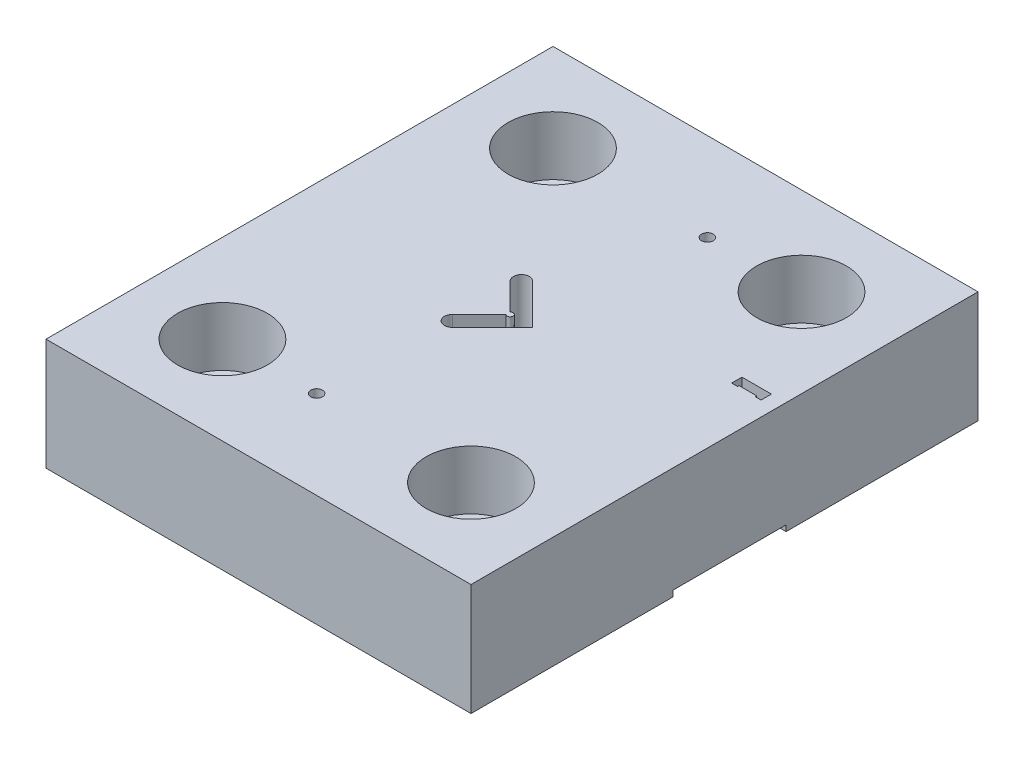
ISO-10303-21;
HEADER;
FILE_DESCRIPTION(('STEP AP214'),'2;1');
FILE_NAME('part.step','',(''),(''),'','','');
FILE_SCHEMA(('AUTOMOTIVE_DESIGN { 1 0 10303 214 1 1 1 1 }'));
ENDSEC;
DATA;
#1=APPLICATION_CONTEXT('core data for automotive mechanical design processes');
#2=APPLICATION_PROTOCOL_DEFINITION('international standard','automotive_design',2000,#1);
#3=PRODUCT_CONTEXT('',#1,'mechanical');
#4=PRODUCT('Part','Part','',(#3));
#5=PRODUCT_RELATED_PRODUCT_CATEGORY('part','',(#4));
#6=PRODUCT_DEFINITION_FORMATION('','',#4);
#7=PRODUCT_DEFINITION_CONTEXT('part definition',#1,'design');
#8=PRODUCT_DEFINITION('design','',#6,#7);
#9=PRODUCT_DEFINITION_SHAPE('','',#8);
#10=(LENGTH_UNIT() NAMED_UNIT(*) SI_UNIT(.MILLI.,.METRE.));
#11=(NAMED_UNIT(*) PLANE_ANGLE_UNIT() SI_UNIT($,.RADIAN.));
#12=(NAMED_UNIT(*) SI_UNIT($,.STERADIAN.) SOLID_ANGLE_UNIT());
#13=UNCERTAINTY_MEASURE_WITH_UNIT(LENGTH_MEASURE(1.E-05),#10,'distance_accuracy_value','');
#14=(GEOMETRIC_REPRESENTATION_CONTEXT(3) GLOBAL_UNCERTAINTY_ASSIGNED_CONTEXT((#13)) GLOBAL_UNIT_ASSIGNED_CONTEXT((#10,
#11,#12)) REPRESENTATION_CONTEXT('',''));
#15=CARTESIAN_POINT('',(0.,0.,0.));
#16=DIRECTION('',(0.,0.,1.));
#17=DIRECTION('',(1.,0.,0.));
#18=AXIS2_PLACEMENT_3D('',#15,#16,#17);
#19=CARTESIAN_POINT('',(-42.25,38.,-56.19));
#20=DIRECTION('',(0.,-1.,0.));
#21=DIRECTION('',(0.,0.,-1.));
#22=AXIS2_PLACEMENT_3D('',#19,#20,#21);
#23=CYLINDRICAL_SURFACE('',#22,10.5000000000004);
#24=CARTESIAN_POINT('',(-42.25,0.,-56.19));
#25=DIRECTION('',(0.,-1.,0.));
#26=DIRECTION('',(0.,0.,-1.));
#27=AXIS2_PLACEMENT_3D('',#24,#25,#26);
#28=CIRCLE('',#27,10.5000000000004);
#29=CARTESIAN_POINT('',(-42.25,0.,-66.6900000000004));
#30=VERTEX_POINT('',#29);
#31=EDGE_CURVE('E373',#30,#30,#28,.T.);
#32=ORIENTED_EDGE('',*,*,#31,.T.);
#33=EDGE_LOOP('',(#32));
#34=FACE_BOUND('',#33,.T.);
#35=CARTESIAN_POINT('',(-42.25,18.,-56.19));
#36=DIRECTION('',(0.,1.,0.));
#37=DIRECTION('',(0.,0.,1.));
#38=AXIS2_PLACEMENT_3D('',#35,#36,#37);
#39=CIRCLE('',#38,10.5000000000004);
#40=CARTESIAN_POINT('',(-42.25,18.,-45.6899999999996));
#41=VERTEX_POINT('',#40);
#42=EDGE_CURVE('E43',#41,#41,#39,.F.);
#43=ORIENTED_EDGE('',*,*,#42,.F.);
#44=EDGE_LOOP('',(#43));
#45=FACE_BOUND('',#44,.T.);
#46=ADVANCED_FACE('F39',(#34,#45),#23,.F.);
#47=CARTESIAN_POINT('',(42.25,38.,56.19));
#48=DIRECTION('',(0.,-1.,0.));
#49=DIRECTION('',(0.,0.,-1.));
#50=AXIS2_PLACEMENT_3D('',#47,#48,#49);
#51=CYLINDRICAL_SURFACE('',#50,10.5000000000004);
#52=CARTESIAN_POINT('',(42.25,0.,56.19));
#53=DIRECTION('',(0.,-1.,0.));
#54=DIRECTION('',(0.,0.,-1.));
#55=AXIS2_PLACEMENT_3D('',#52,#53,#54);
#56=CIRCLE('',#55,10.5000000000004);
#57=CARTESIAN_POINT('',(42.25,0.,45.6899999999996));
#58=VERTEX_POINT('',#57);
#59=EDGE_CURVE('E273',#58,#58,#56,.T.);
#60=ORIENTED_EDGE('',*,*,#59,.T.);
#61=EDGE_LOOP('',(#60));
#62=FACE_BOUND('',#61,.T.);
#63=CARTESIAN_POINT('',(42.25,18.,56.19));
#64=DIRECTION('',(0.,1.,0.));
#65=DIRECTION('',(0.,0.,1.));
#66=AXIS2_PLACEMENT_3D('',#63,#64,#65);
#67=CIRCLE('',#66,10.5000000000004);
#68=CARTESIAN_POINT('',(42.25,18.,66.6900000000004));
#69=VERTEX_POINT('',#68);
#70=EDGE_CURVE('E424',#69,#69,#67,.F.);
#71=ORIENTED_EDGE('',*,*,#70,.F.);
#72=EDGE_LOOP('',(#71));
#73=FACE_BOUND('',#72,.T.);
#74=ADVANCED_FACE('F434',(#62,#73),#51,.F.);
#75=CARTESIAN_POINT('',(-42.25,38.,56.19));
#76=DIRECTION('',(0.,-1.,0.));
#77=DIRECTION('',(0.,0.,-1.));
#78=AXIS2_PLACEMENT_3D('',#75,#76,#77);
#79=CYLINDRICAL_SURFACE('',#78,10.5000000000004);
#80=CARTESIAN_POINT('',(-42.25,0.,56.19));
#81=DIRECTION('',(0.,-1.,0.));
#82=DIRECTION('',(0.,0.,-1.));
#83=AXIS2_PLACEMENT_3D('',#80,#81,#82);
#84=CIRCLE('',#83,10.5000000000004);
#85=CARTESIAN_POINT('',(-42.25,0.,45.6899999999996));
#86=VERTEX_POINT('',#85);
#87=EDGE_CURVE('E380',#86,#86,#84,.T.);
#88=ORIENTED_EDGE('',*,*,#87,.T.);
#89=EDGE_LOOP('',(#88));
#90=FACE_BOUND('',#89,.T.);
#91=CARTESIAN_POINT('',(-42.25,18.,56.19));
#92=DIRECTION('',(0.,1.,0.));
#93=DIRECTION('',(0.,0.,1.));
#94=AXIS2_PLACEMENT_3D('',#91,#92,#93);
#95=CIRCLE('',#94,10.5000000000004);
#96=CARTESIAN_POINT('',(-42.25,18.,66.6900000000004));
#97=VERTEX_POINT('',#96);
#98=EDGE_CURVE('E421',#97,#97,#95,.F.);
#99=ORIENTED_EDGE('',*,*,#98,.F.);
#100=EDGE_LOOP('',(#99));
#101=FACE_BOUND('',#100,.T.);
#102=ADVANCED_FACE('F441',(#90,#101),#79,.F.);
#103=CARTESIAN_POINT('',(42.25,38.,-56.19));
#104=DIRECTION('',(0.,-1.,0.));
#105=DIRECTION('',(0.,0.,-1.));
#106=AXIS2_PLACEMENT_3D('',#103,#104,#105);
#107=CYLINDRICAL_SURFACE('',#106,10.5000000000004);
#108=CARTESIAN_POINT('',(42.25,0.,-56.19));
#109=DIRECTION('',(0.,-1.,0.));
#110=DIRECTION('',(0.,0.,-1.));
#111=AXIS2_PLACEMENT_3D('',#108,#109,#110);
#112=CIRCLE('',#111,10.5000000000004);
#113=CARTESIAN_POINT('',(42.25,0.,-66.6900000000004));
#114=VERTEX_POINT('',#113);
#115=EDGE_CURVE('E377',#114,#114,#112,.T.);
#116=ORIENTED_EDGE('',*,*,#115,.T.);
#117=EDGE_LOOP('',(#116));
#118=FACE_BOUND('',#117,.T.);
#119=CARTESIAN_POINT('',(42.25,18.,-56.19));
#120=DIRECTION('',(0.,1.,0.));
#121=DIRECTION('',(0.,0.,1.));
#122=AXIS2_PLACEMENT_3D('',#119,#120,#121);
#123=CIRCLE('',#122,10.5000000000004);
#124=CARTESIAN_POINT('',(42.25,18.,-45.6899999999996));
#125=VERTEX_POINT('',#124);
#126=EDGE_CURVE('E418',#125,#125,#123,.F.);
#127=ORIENTED_EDGE('',*,*,#126,.F.);
#128=EDGE_LOOP('',(#127));
#129=FACE_BOUND('',#128,.T.);
#130=ADVANCED_FACE('F548',(#118,#129),#107,.F.);
#131=CARTESIAN_POINT('',(72.25,38.,86.19));
#132=DIRECTION('',(-1.,0.,0.));
#133=DIRECTION('',(0.,0.,1.));
#134=AXIS2_PLACEMENT_3D('',#131,#132,#133);
#135=PLANE('',#134);
#136=DIRECTION('',(0.,-1.,0.));
#137=VECTOR('',#136,1.);
#138=CARTESIAN_POINT('',(72.25,2.,17.44));
#139=LINE('',#138,#137);
#140=CARTESIAN_POINT('',(72.25,2.,17.44));
#141=VERTEX_POINT('',#140);
#142=CARTESIAN_POINT('',(72.25,0.,17.44));
#143=VERTEX_POINT('',#142);
#144=EDGE_CURVE('E263',#141,#143,#139,.T.);
#145=ORIENTED_EDGE('',*,*,#144,.F.);
#146=DIRECTION('',(0.,0.,1.));
#147=VECTOR('',#146,1.);
#148=CARTESIAN_POINT('',(72.25,2.,0.));
#149=LINE('',#148,#147);
#150=CARTESIAN_POINT('',(72.25,2.,-20.94));
#151=VERTEX_POINT('',#150);
#152=EDGE_CURVE('E220',#151,#141,#149,.T.);
#153=ORIENTED_EDGE('',*,*,#152,.F.);
#154=DIRECTION('',(0.,-1.,0.));
#155=VECTOR('',#154,1.);
#156=CARTESIAN_POINT('',(72.25,2.,-20.94));
#157=LINE('',#156,#155);
#158=CARTESIAN_POINT('',(72.25,0.,-20.94));
#159=VERTEX_POINT('',#158);
#160=EDGE_CURVE('E266',#151,#159,#157,.T.);
#161=ORIENTED_EDGE('',*,*,#160,.T.);
#162=DIRECTION('',(0.,0.,-1.));
#163=VECTOR('',#162,1.);
#164=CARTESIAN_POINT('',(72.25,0.,86.19));
#165=LINE('',#164,#163);
#166=CARTESIAN_POINT('',(72.25,0.,-86.19));
#167=VERTEX_POINT('',#166);
#168=EDGE_CURVE('E390',#159,#167,#165,.T.);
#169=ORIENTED_EDGE('',*,*,#168,.T.);
#170=DIRECTION('',(0.,-1.,0.));
#171=VECTOR('',#170,1.);
#172=CARTESIAN_POINT('',(72.25,38.,-86.19));
#173=LINE('',#172,#171);
#174=CARTESIAN_POINT('',(72.25,38.,-86.19));
#175=VERTEX_POINT('',#174);
#176=EDGE_CURVE('E12',#175,#167,#173,.T.);
#177=ORIENTED_EDGE('',*,*,#176,.F.);
#178=DIRECTION('',(0.,0.,-1.));
#179=VECTOR('',#178,1.);
#180=CARTESIAN_POINT('',(72.25,38.,86.19));
#181=LINE('',#180,#179);
#182=CARTESIAN_POINT('',(72.25,38.,86.19));
#183=VERTEX_POINT('',#182);
#184=EDGE_CURVE('E391',#183,#175,#181,.T.);
#185=ORIENTED_EDGE('',*,*,#184,.F.);
#186=DIRECTION('',(0.,-1.,0.));
#187=VECTOR('',#186,1.);
#188=CARTESIAN_POINT('',(72.25,38.,86.19));
#189=LINE('',#188,#187);
#190=CARTESIAN_POINT('',(72.25,0.,86.19));
#191=VERTEX_POINT('',#190);
#192=EDGE_CURVE('E401',#183,#191,#189,.T.);
#193=ORIENTED_EDGE('',*,*,#192,.T.);
#194=EDGE_CURVE('E402',#191,#143,#165,.T.);
#195=ORIENTED_EDGE('',*,*,#194,.T.);
#196=EDGE_LOOP('',(#145,#153,#161,#169,#177,#185,#193,#195));
#197=FACE_BOUND('',#196,.T.);
#198=ADVANCED_FACE('F41',(#197),#135,.F.);
#199=CARTESIAN_POINT('',(-72.25,38.,86.19));
#200=DIRECTION('',(1.,0.,0.));
#201=DIRECTION('',(0.,0.,-1.));
#202=AXIS2_PLACEMENT_3D('',#199,#200,#201);
#203=PLANE('',#202);
#204=DIRECTION('',(0.,-1.,0.));
#205=VECTOR('',#204,1.);
#206=CARTESIAN_POINT('',(-72.25,2.,17.44));
#207=LINE('',#206,#205);
#208=CARTESIAN_POINT('',(-72.25,2.,17.44));
#209=VERTEX_POINT('',#208);
#210=CARTESIAN_POINT('',(-72.25,0.,17.44));
#211=VERTEX_POINT('',#210);
#212=EDGE_CURVE('E201',#209,#211,#207,.T.);
#213=ORIENTED_EDGE('',*,*,#212,.T.);
#214=DIRECTION('',(0.,0.,1.));
#215=VECTOR('',#214,1.);
#216=CARTESIAN_POINT('',(-72.25,0.,86.19));
#217=LINE('',#216,#215);
#218=CARTESIAN_POINT('',(-72.25,0.,86.19));
#219=VERTEX_POINT('',#218);
#220=EDGE_CURVE('E407',#211,#219,#217,.T.);
#221=ORIENTED_EDGE('',*,*,#220,.T.);
#222=DIRECTION('',(0.,-1.,0.));
#223=VECTOR('',#222,1.);
#224=CARTESIAN_POINT('',(-72.25,38.,86.19));
#225=LINE('',#224,#223);
#226=CARTESIAN_POINT('',(-72.25,38.,86.19));
#227=VERTEX_POINT('',#226);
#228=EDGE_CURVE('E413',#227,#219,#225,.T.);
#229=ORIENTED_EDGE('',*,*,#228,.F.);
#230=DIRECTION('',(0.,0.,1.));
#231=VECTOR('',#230,1.);
#232=CARTESIAN_POINT('',(-72.25,38.,86.19));
#233=LINE('',#232,#231);
#234=CARTESIAN_POINT('',(-72.25,38.,-86.19));
#235=VERTEX_POINT('',#234);
#236=EDGE_CURVE('E397',#235,#227,#233,.T.);
#237=ORIENTED_EDGE('',*,*,#236,.F.);
#238=DIRECTION('',(0.,-1.,0.));
#239=VECTOR('',#238,1.);
#240=CARTESIAN_POINT('',(-72.25,38.,-86.19));
#241=LINE('',#240,#239);
#242=CARTESIAN_POINT('',(-72.25,0.,-86.19));
#243=VERTEX_POINT('',#242);
#244=EDGE_CURVE('E48',#235,#243,#241,.T.);
#245=ORIENTED_EDGE('',*,*,#244,.T.);
#246=CARTESIAN_POINT('',(-72.25,0.,-17.94));
#247=VERTEX_POINT('',#246);
#248=EDGE_CURVE('E408',#243,#247,#217,.T.);
#249=ORIENTED_EDGE('',*,*,#248,.T.);
#250=DIRECTION('',(0.,-1.,0.));
#251=VECTOR('',#250,1.);
#252=CARTESIAN_POINT('',(-72.25,2.,-17.94));
#253=LINE('',#252,#251);
#254=CARTESIAN_POINT('',(-72.25,2.,-17.94));
#255=VERTEX_POINT('',#254);
#256=EDGE_CURVE('E211',#255,#247,#253,.T.);
#257=ORIENTED_EDGE('',*,*,#256,.F.);
#258=DIRECTION('',(0.,0.,-1.));
#259=VECTOR('',#258,1.);
#260=CARTESIAN_POINT('',(-72.25,2.,0.));
#261=LINE('',#260,#259);
#262=EDGE_CURVE('E216',#209,#255,#261,.T.);
#263=ORIENTED_EDGE('',*,*,#262,.F.);
#264=EDGE_LOOP('',(#213,#221,#229,#237,#245,#249,#257,#263));
#265=FACE_BOUND('',#264,.T.);
#266=ADVANCED_FACE('F224',(#265),#203,.F.);
#267=CARTESIAN_POINT('',(0.,0.,0.));
#268=DIRECTION('',(0.,-1.,0.));
#269=DIRECTION('',(0.,0.,-1.));
#270=AXIS2_PLACEMENT_3D('',#267,#268,#269);
#271=PLANE('',#270);
#272=ORIENTED_EDGE('',*,*,#87,.F.);
#273=EDGE_LOOP('',(#272));
#274=FACE_BOUND('',#273,.T.);
#275=CARTESIAN_POINT('',(-10.25,0.,56.19));
#276=DIRECTION('',(0.,-1.,0.));
#277=DIRECTION('',(0.,0.,-1.));
#278=AXIS2_PLACEMENT_3D('',#275,#276,#277);
#279=CIRCLE('',#278,1.99);
#280=CARTESIAN_POINT('',(-10.25,0.,54.2));
#281=VERTEX_POINT('',#280);
#282=EDGE_CURVE('E276',#281,#281,#279,.T.);
#283=ORIENTED_EDGE('',*,*,#282,.F.);
#284=EDGE_LOOP('',(#283));
#285=FACE_BOUND('',#284,.T.);
#286=ORIENTED_EDGE('',*,*,#59,.F.);
#287=EDGE_LOOP('',(#286));
#288=FACE_BOUND('',#287,.T.);
#289=ORIENTED_EDGE('',*,*,#220,.F.);
#290=DIRECTION('',(1.,0.,0.));
#291=VECTOR('',#290,1.);
#292=CARTESIAN_POINT('',(0.,0.,17.44));
#293=LINE('',#292,#291);
#294=EDGE_CURVE('E207',#211,#143,#293,.T.);
#295=ORIENTED_EDGE('',*,*,#294,.T.);
#296=ORIENTED_EDGE('',*,*,#194,.F.);
#297=DIRECTION('',(1.,0.,0.));
#298=VECTOR('',#297,1.);
#299=CARTESIAN_POINT('',(-72.25,0.,86.19));
#300=LINE('',#299,#298);
#301=EDGE_CURVE('E395',#219,#191,#300,.T.);
#302=ORIENTED_EDGE('',*,*,#301,.F.);
#303=EDGE_LOOP('',(#289,#295,#296,#302));
#304=FACE_BOUND('',#303,.T.);
#305=ADVANCED_FACE('F458',(#274,#285,#288,#304),#271,.T.);
#306=CARTESIAN_POINT('',(67.25,38.,-20.94));
#307=DIRECTION('',(1.,0.,0.));
#308=DIRECTION('',(0.,0.,-1.));
#309=AXIS2_PLACEMENT_3D('',#306,#307,#308);
#310=PLANE('',#309);
#311=DIRECTION('',(0.,0.,-1.));
#312=VECTOR('',#311,1.);
#313=CARTESIAN_POINT('',(67.25,2.,0.));
#314=LINE('',#313,#312);
#315=CARTESIAN_POINT('',(67.25,2.,-17.44));
#316=VERTEX_POINT('',#315);
#317=CARTESIAN_POINT('',(67.25,2.,-20.94));
#318=VERTEX_POINT('',#317);
#319=EDGE_CURVE('E242',#316,#318,#314,.T.);
#320=ORIENTED_EDGE('',*,*,#319,.F.);
#321=DIRECTION('',(0.,-1.,0.));
#322=VECTOR('',#321,1.);
#323=CARTESIAN_POINT('',(67.25,38.,-17.44));
#324=LINE('',#323,#322);
#325=CARTESIAN_POINT('',(67.25,38.,-17.44));
#326=VERTEX_POINT('',#325);
#327=EDGE_CURVE('E345',#326,#316,#324,.T.);
#328=ORIENTED_EDGE('',*,*,#327,.F.);
#329=DIRECTION('',(0.,0.,1.));
#330=VECTOR('',#329,1.);
#331=CARTESIAN_POINT('',(67.25,38.,-20.94));
#332=LINE('',#331,#330);
#333=CARTESIAN_POINT('',(67.25,38.,-20.94));
#334=VERTEX_POINT('',#333);
#335=EDGE_CURVE('E320',#334,#326,#332,.T.);
#336=ORIENTED_EDGE('',*,*,#335,.F.);
#337=DIRECTION('',(0.,-1.,0.));
#338=VECTOR('',#337,1.);
#339=CARTESIAN_POINT('',(67.25,38.,-20.94));
#340=LINE('',#339,#338);
#341=EDGE_CURVE('E282',#334,#318,#340,.T.);
#342=ORIENTED_EDGE('',*,*,#341,.T.);
#343=EDGE_LOOP('',(#320,#328,#336,#342));
#344=FACE_BOUND('',#343,.T.);
#345=ADVANCED_FACE('F514',(#344),#310,.F.);
#346=CARTESIAN_POINT('',(59.25,38.,-17.44));
#347=DIRECTION('',(0.,0.,1.));
#348=DIRECTION('',(1.,0.,0.));
#349=AXIS2_PLACEMENT_3D('',#346,#347,#348);
#350=PLANE('',#349);
#351=DIRECTION('',(1.,0.,0.));
#352=VECTOR('',#351,1.);
#353=CARTESIAN_POINT('',(0.,2.,-17.44));
#354=LINE('',#353,#352);
#355=CARTESIAN_POINT('',(57.25,2.,-17.44));
#356=VERTEX_POINT('',#355);
#357=CARTESIAN_POINT('',(59.25,2.,-17.44));
#358=VERTEX_POINT('',#357);
#359=EDGE_CURVE('E233',#356,#358,#354,.T.);
#360=ORIENTED_EDGE('',*,*,#359,.F.);
#361=DIRECTION('',(0.,-1.,0.));
#362=VECTOR('',#361,1.);
#363=CARTESIAN_POINT('',(57.25,38.,-17.44));
#364=LINE('',#363,#362);
#365=CARTESIAN_POINT('',(57.25,38.,-17.44));
#366=VERTEX_POINT('',#365);
#367=EDGE_CURVE('E353',#366,#356,#364,.T.);
#368=ORIENTED_EDGE('',*,*,#367,.F.);
#369=DIRECTION('',(-1.,0.,0.));
#370=VECTOR('',#369,1.);
#371=CARTESIAN_POINT('',(59.25,38.,-17.44));
#372=LINE('',#371,#370);
#373=CARTESIAN_POINT('',(59.25,38.,-17.44));
#374=VERTEX_POINT('',#373);
#375=EDGE_CURVE('E336',#374,#366,#372,.T.);
#376=ORIENTED_EDGE('',*,*,#375,.F.);
#377=DIRECTION('',(0.,-1.,0.));
#378=VECTOR('',#377,1.);
#379=CARTESIAN_POINT('',(59.25,38.,-17.44));
#380=LINE('',#379,#378);
#381=EDGE_CURVE('E356',#374,#358,#380,.T.);
#382=ORIENTED_EDGE('',*,*,#381,.T.);
#383=EDGE_LOOP('',(#360,#368,#376,#382));
#384=FACE_BOUND('',#383,.T.);
#385=ADVANCED_FACE('F493',(#384),#350,.F.);
#386=CARTESIAN_POINT('',(59.25,38.,-17.94));
#387=DIRECTION('',(1.,0.,0.));
#388=DIRECTION('',(0.,0.,-1.));
#389=AXIS2_PLACEMENT_3D('',#386,#387,#388);
#390=PLANE('',#389);
#391=DIRECTION('',(0.,0.,-1.));
#392=VECTOR('',#391,1.);
#393=CARTESIAN_POINT('',(59.2499999999997,2.,8.22258927613002E-13));
#394=LINE('',#393,#392);
#395=CARTESIAN_POINT('',(59.25,2.,-17.94));
#396=VERTEX_POINT('',#395);
#397=EDGE_CURVE('E235',#358,#396,#394,.T.);
#398=ORIENTED_EDGE('',*,*,#397,.F.);
#399=ORIENTED_EDGE('',*,*,#381,.F.);
#400=DIRECTION('',(0.,0.,1.));
#401=VECTOR('',#400,1.);
#402=CARTESIAN_POINT('',(59.25,38.,-17.94));
#403=LINE('',#402,#401);
#404=CARTESIAN_POINT('',(59.25,38.,-17.94));
#405=VERTEX_POINT('',#404);
#406=EDGE_CURVE('E333',#405,#374,#403,.T.);
#407=ORIENTED_EDGE('',*,*,#406,.F.);
#408=DIRECTION('',(0.,-1.,0.));
#409=VECTOR('',#408,1.);
#410=CARTESIAN_POINT('',(59.25,38.,-17.94));
#411=LINE('',#410,#409);
#412=EDGE_CURVE('E359',#405,#396,#411,.T.);
#413=ORIENTED_EDGE('',*,*,#412,.T.);
#414=EDGE_LOOP('',(#398,#399,#407,#413));
#415=FACE_BOUND('',#414,.T.);
#416=ADVANCED_FACE('F497',(#415),#390,.F.);
#417=CARTESIAN_POINT('',(65.25,38.,-17.94));
#418=DIRECTION('',(0.,0.,1.));
#419=DIRECTION('',(1.,0.,0.));
#420=AXIS2_PLACEMENT_3D('',#417,#418,#419);
#421=PLANE('',#420);
#422=DIRECTION('',(1.,0.,0.));
#423=VECTOR('',#422,1.);
#424=CARTESIAN_POINT('',(0.,2.,-17.94));
#425=LINE('',#424,#423);
#426=CARTESIAN_POINT('',(65.25,2.,-17.94));
#427=VERTEX_POINT('',#426);
#428=EDGE_CURVE('E237',#396,#427,#425,.T.);
#429=ORIENTED_EDGE('',*,*,#428,.F.);
#430=ORIENTED_EDGE('',*,*,#412,.F.);
#431=DIRECTION('',(-1.,0.,0.));
#432=VECTOR('',#431,1.);
#433=CARTESIAN_POINT('',(65.25,38.,-17.94));
#434=LINE('',#433,#432);
#435=CARTESIAN_POINT('',(65.25,38.,-17.94));
#436=VERTEX_POINT('',#435);
#437=EDGE_CURVE('E330',#436,#405,#434,.T.);
#438=ORIENTED_EDGE('',*,*,#437,.F.);
#439=DIRECTION('',(0.,-1.,0.));
#440=VECTOR('',#439,1.);
#441=CARTESIAN_POINT('',(65.25,38.,-17.94));
#442=LINE('',#441,#440);
#443=EDGE_CURVE('E362',#436,#427,#442,.T.);
#444=ORIENTED_EDGE('',*,*,#443,.T.);
#445=EDGE_LOOP('',(#429,#430,#438,#444));
#446=FACE_BOUND('',#445,.T.);
#447=ADVANCED_FACE('F500',(#446),#421,.F.);
#448=CARTESIAN_POINT('',(65.25,38.,-17.44));
#449=DIRECTION('',(-1.,0.,0.));
#450=DIRECTION('',(0.,0.,1.));
#451=AXIS2_PLACEMENT_3D('',#448,#449,#450);
#452=PLANE('',#451);
#453=DIRECTION('',(0.,0.,1.));
#454=VECTOR('',#453,1.);
#455=CARTESIAN_POINT('',(65.25,2.,0.));
#456=LINE('',#455,#454);
#457=CARTESIAN_POINT('',(65.25,2.,-17.44));
#458=VERTEX_POINT('',#457);
#459=EDGE_CURVE('E56',#427,#458,#456,.T.);
#460=ORIENTED_EDGE('',*,*,#459,.F.);
#461=ORIENTED_EDGE('',*,*,#443,.F.);
#462=DIRECTION('',(0.,0.,-1.));
#463=VECTOR('',#462,1.);
#464=CARTESIAN_POINT('',(65.25,38.,-17.44));
#465=LINE('',#464,#463);
#466=CARTESIAN_POINT('',(65.25,38.,-17.44));
#467=VERTEX_POINT('',#466);
#468=EDGE_CURVE('E327',#467,#436,#465,.T.);
#469=ORIENTED_EDGE('',*,*,#468,.F.);
#470=DIRECTION('',(0.,-1.,0.));
#471=VECTOR('',#470,1.);
#472=CARTESIAN_POINT('',(65.25,38.,-17.44));
#473=LINE('',#472,#471);
#474=EDGE_CURVE('E365',#467,#458,#473,.T.);
#475=ORIENTED_EDGE('',*,*,#474,.T.);
#476=EDGE_LOOP('',(#460,#461,#469,#475));
#477=FACE_BOUND('',#476,.T.);
#478=ADVANCED_FACE('F503',(#477),#452,.F.);
#479=CARTESIAN_POINT('',(67.25,38.,-17.44));
#480=DIRECTION('',(0.,0.,1.));
#481=DIRECTION('',(1.,0.,0.));
#482=AXIS2_PLACEMENT_3D('',#479,#480,#481);
#483=PLANE('',#482);
#484=DIRECTION('',(1.,0.,0.));
#485=VECTOR('',#484,1.);
#486=CARTESIAN_POINT('',(0.,2.,-17.44));
#487=LINE('',#486,#485);
#488=EDGE_CURVE('E240',#458,#316,#487,.T.);
#489=ORIENTED_EDGE('',*,*,#488,.F.);
#490=ORIENTED_EDGE('',*,*,#474,.F.);
#491=DIRECTION('',(-1.,0.,0.));
#492=VECTOR('',#491,1.);
#493=CARTESIAN_POINT('',(67.25,38.,-17.44));
#494=LINE('',#493,#492);
#495=EDGE_CURVE('E323',#326,#467,#494,.T.);
#496=ORIENTED_EDGE('',*,*,#495,.F.);
#497=ORIENTED_EDGE('',*,*,#327,.T.);
#498=EDGE_LOOP('',(#489,#490,#496,#497));
#499=FACE_BOUND('',#498,.T.);
#500=ADVANCED_FACE('F507',(#499),#483,.F.);
#501=CARTESIAN_POINT('',(-8.54634918610406,38.,-11.7379725676967));
#502=DIRECTION('',(0.,-1.,0.));
#503=DIRECTION('',(0.,0.,-1.));
#504=AXIS2_PLACEMENT_3D('',#501,#502,#503);
#505=CYLINDRICAL_SURFACE('',#504,2.7);
#506=CARTESIAN_POINT('',(-8.54634918610406,2.,-11.7379725676967));
#507=DIRECTION('',(0.,-1.,0.));
#508=DIRECTION('',(0.,0.,-1.));
#509=AXIS2_PLACEMENT_3D('',#506,#507,#508);
#510=CIRCLE('',#509,2.7);
#511=CARTESIAN_POINT('',(-6.63716087690038,2.,-13.6471608769004));
#512=VERTEX_POINT('',#511);
#513=CARTESIAN_POINT('',(-10.4555374953077,2.,-9.82878425849301));
#514=VERTEX_POINT('',#513);
#515=EDGE_CURVE('E250',#512,#514,#510,.F.);
#516=ORIENTED_EDGE('',*,*,#515,.F.);
#517=DIRECTION('',(0.,-1.,0.));
#518=VECTOR('',#517,1.);
#519=CARTESIAN_POINT('',(-6.63716087690038,38.,-13.6471608769004));
#520=LINE('',#519,#518);
#521=CARTESIAN_POINT('',(-6.63716087690038,38.,-13.6471608769004));
#522=VERTEX_POINT('',#521);
#523=EDGE_CURVE('E300',#522,#512,#520,.T.);
#524=ORIENTED_EDGE('',*,*,#523,.F.);
#525=CARTESIAN_POINT('',(-8.54634918610406,38.,-11.7379725676967));
#526=DIRECTION('',(0.,-1.,0.));
#527=DIRECTION('',(0.,0.,-1.));
#528=AXIS2_PLACEMENT_3D('',#525,#526,#527);
#529=CIRCLE('',#528,2.7);
#530=CARTESIAN_POINT('',(-10.4555374953077,38.,-9.82878425849301));
#531=VERTEX_POINT('',#530);
#532=EDGE_CURVE('E278',#531,#522,#529,.T.);
#533=ORIENTED_EDGE('',*,*,#532,.F.);
#534=DIRECTION('',(0.,-1.,0.));
#535=VECTOR('',#534,1.);
#536=CARTESIAN_POINT('',(-10.4555374953077,38.,-9.82878425849301));
#537=LINE('',#536,#535);
#538=EDGE_CURVE('E277',#531,#514,#537,.T.);
#539=ORIENTED_EDGE('',*,*,#538,.T.);
#540=EDGE_LOOP('',(#516,#524,#533,#539));
#541=FACE_BOUND('',#540,.T.);
#542=ADVANCED_FACE('F530',(#541),#505,.F.);
#543=CARTESIAN_POINT('',(-1.33386001800127,38.,-0.707106781186542));
#544=DIRECTION('',(-0.707106781186548,0.,0.707106781186548));
#545=DIRECTION('',(0.707106781186548,0.,0.707106781186547));
#546=AXIS2_PLACEMENT_3D('',#543,#544,#545);
#547=PLANE('',#546);
#548=DIRECTION('',(0.707106781186548,0.,0.707106781186547));
#549=VECTOR('',#548,1.);
#550=CARTESIAN_POINT('',(-0.313376618407364,2.,0.313376618407364));
#551=LINE('',#550,#549);
#552=CARTESIAN_POINT('',(-1.33386001800127,2.,-0.707106781186542));
#553=VERTEX_POINT('',#552);
#554=EDGE_CURVE('E252',#514,#553,#551,.T.);
#555=ORIENTED_EDGE('',*,*,#554,.F.);
#556=ORIENTED_EDGE('',*,*,#538,.F.);
#557=DIRECTION('',(-0.707106781186548,0.,-0.707106781186547));
#558=VECTOR('',#557,1.);
#559=CARTESIAN_POINT('',(-1.33386001800127,38.,-0.707106781186542));
#560=LINE('',#559,#558);
#561=CARTESIAN_POINT('',(-1.33386001800127,38.,-0.707106781186542));
#562=VERTEX_POINT('',#561);
#563=EDGE_CURVE('E297',#562,#531,#560,.T.);
#564=ORIENTED_EDGE('',*,*,#563,.F.);
#565=DIRECTION('',(0.,-1.,0.));
#566=VECTOR('',#565,1.);
#567=CARTESIAN_POINT('',(-1.33386001800127,38.,-0.707106781186542));
#568=LINE('',#567,#566);
#569=EDGE_CURVE('E303',#562,#553,#568,.T.);
#570=ORIENTED_EDGE('',*,*,#569,.T.);
#571=EDGE_LOOP('',(#555,#556,#564,#570));
#572=FACE_BOUND('',#571,.T.);
#573=ADVANCED_FACE('F593',(#572),#547,.F.);
#574=CARTESIAN_POINT('',(-0.626753236814721,38.,0.));
#575=DIRECTION('',(0.,-1.,0.));
#576=DIRECTION('',(0.,0.,-1.));
#577=AXIS2_PLACEMENT_3D('',#574,#575,#576);
#578=CYLINDRICAL_SURFACE('',#577,0.999999999999997);
#579=CARTESIAN_POINT('',(-0.626753236814721,2.,0.));
#580=DIRECTION('',(0.,-1.,0.));
#581=DIRECTION('',(0.,0.,-1.));
#582=AXIS2_PLACEMENT_3D('',#579,#580,#581);
#583=CIRCLE('',#582,0.999999999999997);
#584=CARTESIAN_POINT('',(-1.33386001800127,2.,0.707106781186547));
#585=VERTEX_POINT('',#584);
#586=EDGE_CURVE('E254',#553,#585,#583,.T.);
#587=ORIENTED_EDGE('',*,*,#586,.F.);
#588=ORIENTED_EDGE('',*,*,#569,.F.);
#589=CARTESIAN_POINT('',(-0.626753236814721,38.,0.));
#590=DIRECTION('',(0.,1.,0.));
#591=DIRECTION('',(0.,0.,-1.));
#592=AXIS2_PLACEMENT_3D('',#589,#590,#591);
#593=CIRCLE('',#592,0.999999999999997);
#594=CARTESIAN_POINT('',(-1.33386001800127,38.,0.707106781186546));
#595=VERTEX_POINT('',#594);
#596=EDGE_CURVE('E294',#595,#562,#593,.T.);
#597=ORIENTED_EDGE('',*,*,#596,.F.);
#598=DIRECTION('',(0.,-1.,0.));
#599=VECTOR('',#598,1.);
#600=CARTESIAN_POINT('',(-1.33386001800127,38.,0.707106781186546));
#601=LINE('',#600,#599);
#602=EDGE_CURVE('E306',#595,#585,#601,.T.);
#603=ORIENTED_EDGE('',*,*,#602,.T.);
#604=EDGE_LOOP('',(#587,#588,#597,#603));
#605=FACE_BOUND('',#604,.T.);
#606=ADVANCED_FACE('F596',(#605),#578,.T.);
#607=CARTESIAN_POINT('',(-10.4555374953077,38.,9.82878425849302));
#608=DIRECTION('',(-0.707106781186548,0.,-0.707106781186547));
#609=DIRECTION('',(-0.707106781186547,0.,0.707106781186548));
#610=AXIS2_PLACEMENT_3D('',#607,#608,#609);
#611=PLANE('',#610);
#612=DIRECTION('',(-0.707106781186547,0.,0.707106781186548));
#613=VECTOR('',#612,1.);
#614=CARTESIAN_POINT('',(-0.313376618407361,2.,-0.313376618407361));
#615=LINE('',#614,#613);
#616=CARTESIAN_POINT('',(-10.4555374953077,2.,9.82878425849302));
#617=VERTEX_POINT('',#616);
#618=EDGE_CURVE('E256',#585,#617,#615,.T.);
#619=ORIENTED_EDGE('',*,*,#618,.F.);
#620=ORIENTED_EDGE('',*,*,#602,.F.);
#621=DIRECTION('',(0.707106781186547,0.,-0.707106781186548));
#622=VECTOR('',#621,1.);
#623=CARTESIAN_POINT('',(-10.4555374953077,38.,9.82878425849302));
#624=LINE('',#623,#622);
#625=CARTESIAN_POINT('',(-10.4555374953077,38.,9.82878425849302));
#626=VERTEX_POINT('',#625);
#627=EDGE_CURVE('E291',#626,#595,#624,.T.);
#628=ORIENTED_EDGE('',*,*,#627,.F.);
#629=DIRECTION('',(0.,-1.,0.));
#630=VECTOR('',#629,1.);
#631=CARTESIAN_POINT('',(-10.4555374953077,38.,9.82878425849302));
#632=LINE('',#631,#630);
#633=EDGE_CURVE('E309',#626,#617,#632,.T.);
#634=ORIENTED_EDGE('',*,*,#633,.T.);
#635=EDGE_LOOP('',(#619,#620,#628,#634));
#636=FACE_BOUND('',#635,.T.);
#637=ADVANCED_FACE('F600',(#636),#611,.F.);
#638=CARTESIAN_POINT('',(-8.54634918610405,38.,11.7379725676967));
#639=DIRECTION('',(0.,-1.,0.));
#640=DIRECTION('',(0.,0.,-1.));
#641=AXIS2_PLACEMENT_3D('',#638,#639,#640);
#642=CYLINDRICAL_SURFACE('',#641,2.7);
#643=CARTESIAN_POINT('',(-8.54634918610405,2.,11.7379725676967));
#644=DIRECTION('',(0.,-1.,0.));
#645=DIRECTION('',(0.,0.,-1.));
#646=AXIS2_PLACEMENT_3D('',#643,#644,#645);
#647=CIRCLE('',#646,2.7);
#648=CARTESIAN_POINT('',(-6.63716087690038,2.,13.6471608769004));
#649=VERTEX_POINT('',#648);
#650=EDGE_CURVE('E258',#617,#649,#647,.F.);
#651=ORIENTED_EDGE('',*,*,#650,.F.);
#652=ORIENTED_EDGE('',*,*,#633,.F.);
#653=CARTESIAN_POINT('',(-8.54634918610405,38.,11.7379725676967));
#654=DIRECTION('',(0.,-1.,0.));
#655=DIRECTION('',(0.,0.,-1.));
#656=AXIS2_PLACEMENT_3D('',#653,#654,#655);
#657=CIRCLE('',#656,2.7);
#658=CARTESIAN_POINT('',(-6.63716087690038,38.,13.6471608769004));
#659=VERTEX_POINT('',#658);
#660=EDGE_CURVE('E288',#659,#626,#657,.T.);
#661=ORIENTED_EDGE('',*,*,#660,.F.);
#662=DIRECTION('',(0.,-1.,0.));
#663=VECTOR('',#662,1.);
#664=CARTESIAN_POINT('',(-6.63716087690038,38.,13.6471608769004));
#665=LINE('',#664,#663);
#666=EDGE_CURVE('E312',#659,#649,#665,.T.);
#667=ORIENTED_EDGE('',*,*,#666,.T.);
#668=EDGE_LOOP('',(#651,#652,#661,#667));
#669=FACE_BOUND('',#668,.T.);
#670=ADVANCED_FACE('F604',(#669),#642,.F.);
#671=CARTESIAN_POINT('',(7.00999999999999,38.,0.));
#672=DIRECTION('',(0.707106781186548,0.,0.707106781186548));
#673=DIRECTION('',(0.707106781186547,0.,-0.707106781186548));
#674=AXIS2_PLACEMENT_3D('',#671,#672,#673);
#675=PLANE('',#674);
#676=DIRECTION('',(0.707106781186547,0.,-0.707106781186548));
#677=VECTOR('',#676,1.);
#678=CARTESIAN_POINT('',(3.505,2.,3.505));
#679=LINE('',#678,#677);
#680=CARTESIAN_POINT('',(7.00999999999999,2.,0.));
#681=VERTEX_POINT('',#680);
#682=EDGE_CURVE('E64',#649,#681,#679,.T.);
#683=ORIENTED_EDGE('',*,*,#682,.F.);
#684=ORIENTED_EDGE('',*,*,#666,.F.);
#685=DIRECTION('',(-0.707106781186547,0.,0.707106781186548));
#686=VECTOR('',#685,1.);
#687=CARTESIAN_POINT('',(7.00999999999999,38.,0.));
#688=LINE('',#687,#686);
#689=CARTESIAN_POINT('',(7.00999999999999,38.,0.));
#690=VERTEX_POINT('',#689);
#691=EDGE_CURVE('E285',#690,#659,#688,.T.);
#692=ORIENTED_EDGE('',*,*,#691,.F.);
#693=DIRECTION('',(0.,-1.,0.));
#694=VECTOR('',#693,1.);
#695=CARTESIAN_POINT('',(7.00999999999999,38.,0.));
#696=LINE('',#695,#694);
#697=EDGE_CURVE('E315',#690,#681,#696,.T.);
#698=ORIENTED_EDGE('',*,*,#697,.T.);
#699=EDGE_LOOP('',(#683,#684,#692,#698));
#700=FACE_BOUND('',#699,.T.);
#701=ADVANCED_FACE('F470',(#700),#675,.F.);
#702=CARTESIAN_POINT('',(-6.63716087690038,38.,-13.6471608769004));
#703=DIRECTION('',(0.707106781186548,0.,-0.707106781186548));
#704=DIRECTION('',(-0.707106781186548,0.,-0.707106781186548));
#705=AXIS2_PLACEMENT_3D('',#702,#703,#704);
#706=PLANE('',#705);
#707=DIRECTION('',(-0.707106781186548,0.,-0.707106781186548));
#708=VECTOR('',#707,1.);
#709=CARTESIAN_POINT('',(3.50499999999999,2.,-3.50499999999999));
#710=LINE('',#709,#708);
#711=EDGE_CURVE('E248',#681,#512,#710,.T.);
#712=ORIENTED_EDGE('',*,*,#711,.F.);
#713=ORIENTED_EDGE('',*,*,#697,.F.);
#714=DIRECTION('',(0.707106781186548,0.,0.707106781186547));
#715=VECTOR('',#714,1.);
#716=CARTESIAN_POINT('',(-6.63716087690038,38.,-13.6471608769004));
#717=LINE('',#716,#715);
#718=EDGE_CURVE('E281',#522,#690,#717,.T.);
#719=ORIENTED_EDGE('',*,*,#718,.F.);
#720=ORIENTED_EDGE('',*,*,#523,.T.);
#721=EDGE_LOOP('',(#712,#713,#719,#720));
#722=FACE_BOUND('',#721,.T.);
#723=ADVANCED_FACE('F465',(#722),#706,.F.);
#724=CARTESIAN_POINT('',(-72.25,38.,-86.19));
#725=DIRECTION('',(0.,0.,1.));
#726=DIRECTION('',(1.,0.,0.));
#727=AXIS2_PLACEMENT_3D('',#724,#725,#726);
#728=PLANE('',#727);
#729=DIRECTION('',(-1.,0.,0.));
#730=VECTOR('',#729,1.);
#731=CARTESIAN_POINT('',(-72.25,0.,-86.19));
#732=LINE('',#731,#730);
#733=EDGE_CURVE('E405',#167,#243,#732,.T.);
#734=ORIENTED_EDGE('',*,*,#733,.T.);
#735=ORIENTED_EDGE('',*,*,#244,.F.);
#736=DIRECTION('',(-1.,0.,0.));
#737=VECTOR('',#736,1.);
#738=CARTESIAN_POINT('',(-72.25,38.,-86.19));
#739=LINE('',#738,#737);
#740=EDGE_CURVE('E394',#175,#235,#739,.T.);
#741=ORIENTED_EDGE('',*,*,#740,.F.);
#742=ORIENTED_EDGE('',*,*,#176,.T.);
#743=EDGE_LOOP('',(#734,#735,#741,#742));
#744=FACE_BOUND('',#743,.T.);
#745=ADVANCED_FACE('F461',(#744),#728,.F.);
#746=CARTESIAN_POINT('',(-72.25,38.,86.19));
#747=DIRECTION('',(0.,0.,-1.));
#748=DIRECTION('',(-1.,0.,0.));
#749=AXIS2_PLACEMENT_3D('',#746,#747,#748);
#750=PLANE('',#749);
#751=ORIENTED_EDGE('',*,*,#301,.T.);
#752=ORIENTED_EDGE('',*,*,#192,.F.);
#753=DIRECTION('',(1.,0.,0.));
#754=VECTOR('',#753,1.);
#755=CARTESIAN_POINT('',(-72.25,38.,86.19));
#756=LINE('',#755,#754);
#757=EDGE_CURVE('E399',#227,#183,#756,.T.);
#758=ORIENTED_EDGE('',*,*,#757,.F.);
#759=ORIENTED_EDGE('',*,*,#228,.T.);
#760=EDGE_LOOP('',(#751,#752,#758,#759));
#761=FACE_BOUND('',#760,.T.);
#762=ADVANCED_FACE('F452',(#761),#750,.F.);
#763=CARTESIAN_POINT('',(0.,38.,0.));
#764=DIRECTION('',(0.,-1.,0.));
#765=DIRECTION('',(0.,0.,-1.));
#766=AXIS2_PLACEMENT_3D('',#763,#764,#765);
#767=PLANE('',#766);
#768=CARTESIAN_POINT('',(-42.25,38.,56.19));
#769=DIRECTION('',(0.,1.,0.));
#770=DIRECTION('',(0.,0.,1.));
#771=AXIS2_PLACEMENT_3D('',#768,#769,#770);
#772=CIRCLE('',#771,15.25);
#773=CARTESIAN_POINT('',(-42.25,38.,71.44));
#774=VERTEX_POINT('',#773);
#775=EDGE_CURVE('E789',#774,#774,#772,.T.);
#776=ORIENTED_EDGE('',*,*,#775,.F.);
#777=EDGE_LOOP('',(#776));
#778=FACE_BOUND('',#777,.T.);
#779=CARTESIAN_POINT('',(42.25,38.,56.19));
#780=DIRECTION('',(0.,1.,0.));
#781=DIRECTION('',(0.,0.,1.));
#782=AXIS2_PLACEMENT_3D('',#779,#780,#781);
#783=CIRCLE('',#782,15.25);
#784=CARTESIAN_POINT('',(42.25,38.,71.44));
#785=VERTEX_POINT('',#784);
#786=EDGE_CURVE('E783',#785,#785,#783,.T.);
#787=ORIENTED_EDGE('',*,*,#786,.F.);
#788=EDGE_LOOP('',(#787));
#789=FACE_BOUND('',#788,.T.);
#790=CARTESIAN_POINT('',(42.25,38.,-56.19));
#791=DIRECTION('',(0.,1.,0.));
#792=DIRECTION('',(0.,0.,1.));
#793=AXIS2_PLACEMENT_3D('',#790,#791,#792);
#794=CIRCLE('',#793,15.25);
#795=CARTESIAN_POINT('',(42.25,38.,-40.94));
#796=VERTEX_POINT('',#795);
#797=EDGE_CURVE('E787',#796,#796,#794,.T.);
#798=ORIENTED_EDGE('',*,*,#797,.F.);
#799=EDGE_LOOP('',(#798));
#800=FACE_BOUND('',#799,.T.);
#801=CARTESIAN_POINT('',(-42.25,38.,-56.19));
#802=DIRECTION('',(0.,1.,0.));
#803=DIRECTION('',(0.,0.,1.));
#804=AXIS2_PLACEMENT_3D('',#801,#802,#803);
#805=CIRCLE('',#804,15.25);
#806=CARTESIAN_POINT('',(-42.25,38.,-40.94));
#807=VERTEX_POINT('',#806);
#808=EDGE_CURVE('E796',#807,#807,#805,.T.);
#809=ORIENTED_EDGE('',*,*,#808,.F.);
#810=EDGE_LOOP('',(#809));
#811=FACE_BOUND('',#810,.T.);
#812=CARTESIAN_POINT('',(10.25,38.,-56.19));
#813=DIRECTION('',(0.,-1.,0.));
#814=DIRECTION('',(0.,0.,-1.));
#815=AXIS2_PLACEMENT_3D('',#812,#813,#814);
#816=CIRCLE('',#815,1.99);
#817=CARTESIAN_POINT('',(10.25,38.,-58.18));
#818=VERTEX_POINT('',#817);
#819=EDGE_CURVE('E370',#818,#818,#816,.T.);
#820=ORIENTED_EDGE('',*,*,#819,.T.);
#821=EDGE_LOOP('',(#820));
#822=FACE_BOUND('',#821,.T.);
#823=CARTESIAN_POINT('',(-10.25,38.,56.19));
#824=DIRECTION('',(0.,-1.,0.));
#825=DIRECTION('',(0.,0.,-1.));
#826=AXIS2_PLACEMENT_3D('',#823,#824,#825);
#827=CIRCLE('',#826,1.99);
#828=CARTESIAN_POINT('',(-10.25,38.,54.2));
#829=VERTEX_POINT('',#828);
#830=EDGE_CURVE('E383',#829,#829,#827,.T.);
#831=ORIENTED_EDGE('',*,*,#830,.T.);
#832=EDGE_LOOP('',(#831));
#833=FACE_BOUND('',#832,.T.);
#834=ORIENTED_EDGE('',*,*,#563,.T.);
#835=ORIENTED_EDGE('',*,*,#532,.T.);
#836=ORIENTED_EDGE('',*,*,#718,.T.);
#837=ORIENTED_EDGE('',*,*,#691,.T.);
#838=ORIENTED_EDGE('',*,*,#660,.T.);
#839=ORIENTED_EDGE('',*,*,#627,.T.);
#840=ORIENTED_EDGE('',*,*,#596,.T.);
#841=EDGE_LOOP('',(#834,#835,#836,#837,#838,#839,#840));
#842=FACE_BOUND('',#841,.T.);
#843=DIRECTION('',(1.,0.,0.));
#844=VECTOR('',#843,1.);
#845=CARTESIAN_POINT('',(57.25,38.,-20.94));
#846=LINE('',#845,#844);
#847=CARTESIAN_POINT('',(57.25,38.,-20.94));
#848=VERTEX_POINT('',#847);
#849=EDGE_CURVE('E342',#848,#334,#846,.T.);
#850=ORIENTED_EDGE('',*,*,#849,.T.);
#851=ORIENTED_EDGE('',*,*,#335,.T.);
#852=ORIENTED_EDGE('',*,*,#495,.T.);
#853=ORIENTED_EDGE('',*,*,#468,.T.);
#854=ORIENTED_EDGE('',*,*,#437,.T.);
#855=ORIENTED_EDGE('',*,*,#406,.T.);
#856=ORIENTED_EDGE('',*,*,#375,.T.);
#857=DIRECTION('',(0.,0.,-1.));
#858=VECTOR('',#857,1.);
#859=CARTESIAN_POINT('',(57.25,38.,-17.44));
#860=LINE('',#859,#858);
#861=EDGE_CURVE('E339',#366,#848,#860,.T.);
#862=ORIENTED_EDGE('',*,*,#861,.T.);
#863=EDGE_LOOP('',(#850,#851,#852,#853,#854,#855,#856,#862));
#864=FACE_BOUND('',#863,.T.);
#865=ORIENTED_EDGE('',*,*,#184,.T.);
#866=ORIENTED_EDGE('',*,*,#740,.T.);
#867=ORIENTED_EDGE('',*,*,#236,.T.);
#868=ORIENTED_EDGE('',*,*,#757,.T.);
#869=EDGE_LOOP('',(#865,#866,#867,#868));
#870=FACE_BOUND('',#869,.T.);
#871=ADVANCED_FACE('F448',(#778,#789,#800,#811,#822,#833,#842,#864,#870),#767,.F.);
#872=ORIENTED_EDGE('',*,*,#168,.F.);
#873=DIRECTION('',(1.,0.,0.));
#874=VECTOR('',#873,1.);
#875=CARTESIAN_POINT('',(57.25,0.,-20.94));
#876=LINE('',#875,#874);
#877=CARTESIAN_POINT('',(57.25,0.,-20.94));
#878=VERTEX_POINT('',#877);
#879=EDGE_CURVE('E324',#878,#159,#876,.T.);
#880=ORIENTED_EDGE('',*,*,#879,.F.);
#881=DIRECTION('',(0.,0.,-1.));
#882=VECTOR('',#881,1.);
#883=CARTESIAN_POINT('',(57.25,0.,-17.44));
#884=LINE('',#883,#882);
#885=CARTESIAN_POINT('',(57.25,0.,-17.94));
#886=VERTEX_POINT('',#885);
#887=EDGE_CURVE('E265',#886,#878,#884,.T.);
#888=ORIENTED_EDGE('',*,*,#887,.F.);
#889=DIRECTION('',(1.,0.,0.));
#890=VECTOR('',#889,1.);
#891=CARTESIAN_POINT('',(0.,0.,-17.94));
#892=LINE('',#891,#890);
#893=EDGE_CURVE('E222',#247,#886,#892,.T.);
#894=ORIENTED_EDGE('',*,*,#893,.F.);
#895=ORIENTED_EDGE('',*,*,#248,.F.);
#896=ORIENTED_EDGE('',*,*,#733,.F.);
#897=EDGE_LOOP('',(#872,#880,#888,#894,#895,#896));
#898=FACE_BOUND('',#897,.T.);
#899=CARTESIAN_POINT('',(10.25,0.,-56.19));
#900=DIRECTION('',(0.,-1.,0.));
#901=DIRECTION('',(0.,0.,-1.));
#902=AXIS2_PLACEMENT_3D('',#899,#900,#901);
#903=CIRCLE('',#902,1.99);
#904=CARTESIAN_POINT('',(10.25,0.,-58.18));
#905=VERTEX_POINT('',#904);
#906=EDGE_CURVE('E374',#905,#905,#903,.T.);
#907=ORIENTED_EDGE('',*,*,#906,.F.);
#908=EDGE_LOOP('',(#907));
#909=FACE_BOUND('',#908,.T.);
#910=ORIENTED_EDGE('',*,*,#115,.F.);
#911=EDGE_LOOP('',(#910));
#912=FACE_BOUND('',#911,.T.);
#913=ORIENTED_EDGE('',*,*,#31,.F.);
#914=EDGE_LOOP('',(#913));
#915=FACE_BOUND('',#914,.T.);
#916=ADVANCED_FACE('F451',(#898,#909,#912,#915),#271,.T.);
#917=CARTESIAN_POINT('',(57.25,38.,-20.94));
#918=DIRECTION('',(0.,0.,-1.));
#919=DIRECTION('',(-1.,0.,0.));
#920=AXIS2_PLACEMENT_3D('',#917,#918,#919);
#921=PLANE('',#920);
#922=ORIENTED_EDGE('',*,*,#879,.T.);
#923=ORIENTED_EDGE('',*,*,#160,.F.);
#924=DIRECTION('',(1.,0.,0.));
#925=VECTOR('',#924,1.);
#926=CARTESIAN_POINT('',(0.,2.,-20.94));
#927=LINE('',#926,#925);
#928=EDGE_CURVE('E245',#318,#151,#927,.T.);
#929=ORIENTED_EDGE('',*,*,#928,.F.);
#930=ORIENTED_EDGE('',*,*,#341,.F.);
#931=ORIENTED_EDGE('',*,*,#849,.F.);
#932=DIRECTION('',(0.,-1.,0.));
#933=VECTOR('',#932,1.);
#934=CARTESIAN_POINT('',(57.25,38.,-20.94));
#935=LINE('',#934,#933);
#936=EDGE_CURVE('E350',#848,#878,#935,.T.);
#937=ORIENTED_EDGE('',*,*,#936,.T.);
#938=EDGE_LOOP('',(#922,#923,#929,#930,#931,#937));
#939=FACE_BOUND('',#938,.T.);
#940=ADVANCED_FACE('F456',(#939),#921,.F.);
#941=CARTESIAN_POINT('',(57.25,38.,-17.44));
#942=DIRECTION('',(-1.,0.,0.));
#943=DIRECTION('',(0.,0.,1.));
#944=AXIS2_PLACEMENT_3D('',#941,#942,#943);
#945=PLANE('',#944);
#946=DIRECTION('',(0.,0.,1.));
#947=VECTOR('',#946,1.);
#948=CARTESIAN_POINT('',(57.2499999999999,2.,1.13500478856768E-13));
#949=LINE('',#948,#947);
#950=CARTESIAN_POINT('',(57.25,2.,-17.94));
#951=VERTEX_POINT('',#950);
#952=EDGE_CURVE('E228',#951,#356,#949,.T.);
#953=ORIENTED_EDGE('',*,*,#952,.F.);
#954=DIRECTION('',(0.,-1.,0.));
#955=VECTOR('',#954,1.);
#956=CARTESIAN_POINT('',(57.25,2.,-17.94));
#957=LINE('',#956,#955);
#958=EDGE_CURVE('E269',#951,#886,#957,.T.);
#959=ORIENTED_EDGE('',*,*,#958,.T.);
#960=ORIENTED_EDGE('',*,*,#887,.T.);
#961=ORIENTED_EDGE('',*,*,#936,.F.);
#962=ORIENTED_EDGE('',*,*,#861,.F.);
#963=ORIENTED_EDGE('',*,*,#367,.T.);
#964=EDGE_LOOP('',(#953,#959,#960,#961,#962,#963));
#965=FACE_BOUND('',#964,.T.);
#966=ADVANCED_FACE('F488',(#965),#945,.F.);
#967=CARTESIAN_POINT('',(-10.25,38.,56.19));
#968=DIRECTION('',(0.,-1.,0.));
#969=DIRECTION('',(0.,0.,-1.));
#970=AXIS2_PLACEMENT_3D('',#967,#968,#969);
#971=CYLINDRICAL_SURFACE('',#970,1.99);
#972=ORIENTED_EDGE('',*,*,#830,.F.);
#973=EDGE_LOOP('',(#972));
#974=FACE_BOUND('',#973,.T.);
#975=ORIENTED_EDGE('',*,*,#282,.T.);
#976=EDGE_LOOP('',(#975));
#977=FACE_BOUND('',#976,.T.);
#978=ADVANCED_FACE('F446',(#974,#977),#971,.F.);
#979=CARTESIAN_POINT('',(10.25,38.,-56.19));
#980=DIRECTION('',(0.,-1.,0.));
#981=DIRECTION('',(0.,0.,-1.));
#982=AXIS2_PLACEMENT_3D('',#979,#980,#981);
#983=CYLINDRICAL_SURFACE('',#982,1.99);
#984=ORIENTED_EDGE('',*,*,#819,.F.);
#985=EDGE_LOOP('',(#984));
#986=FACE_BOUND('',#985,.T.);
#987=ORIENTED_EDGE('',*,*,#906,.T.);
#988=EDGE_LOOP('',(#987));
#989=FACE_BOUND('',#988,.T.);
#990=ADVANCED_FACE('F544',(#986,#989),#983,.F.);
#991=CARTESIAN_POINT('',(0.,2.,17.44));
#992=DIRECTION('',(0.,0.,-1.));
#993=DIRECTION('',(-1.,0.,0.));
#994=AXIS2_PLACEMENT_3D('',#991,#992,#993);
#995=PLANE('',#994);
#996=ORIENTED_EDGE('',*,*,#294,.F.);
#997=ORIENTED_EDGE('',*,*,#212,.F.);
#998=DIRECTION('',(1.,0.,0.));
#999=VECTOR('',#998,1.);
#1000=CARTESIAN_POINT('',(0.,2.,17.44));
#1001=LINE('',#1000,#999);
#1002=EDGE_CURVE('E204',#209,#141,#1001,.T.);
#1003=ORIENTED_EDGE('',*,*,#1002,.T.);
#1004=ORIENTED_EDGE('',*,*,#144,.T.);
#1005=EDGE_LOOP('',(#996,#997,#1003,#1004));
#1006=FACE_BOUND('',#1005,.T.);
#1007=ADVANCED_FACE('F203',(#1006),#995,.T.);
#1008=CARTESIAN_POINT('',(0.,2.,-17.94));
#1009=DIRECTION('',(0.,0.,-1.));
#1010=DIRECTION('',(-1.,0.,0.));
#1011=AXIS2_PLACEMENT_3D('',#1008,#1009,#1010);
#1012=PLANE('',#1011);
#1013=ORIENTED_EDGE('',*,*,#893,.T.);
#1014=ORIENTED_EDGE('',*,*,#958,.F.);
#1015=DIRECTION('',(1.,0.,0.));
#1016=VECTOR('',#1015,1.);
#1017=CARTESIAN_POINT('',(0.,2.,-17.94));
#1018=LINE('',#1017,#1016);
#1019=EDGE_CURVE('E226',#255,#951,#1018,.T.);
#1020=ORIENTED_EDGE('',*,*,#1019,.F.);
#1021=ORIENTED_EDGE('',*,*,#256,.T.);
#1022=EDGE_LOOP('',(#1013,#1014,#1020,#1021));
#1023=FACE_BOUND('',#1022,.T.);
#1024=ADVANCED_FACE('F485',(#1023),#1012,.F.);
#1025=CARTESIAN_POINT('',(0.,2.,0.));
#1026=DIRECTION('',(0.,-1.,0.));
#1027=DIRECTION('',(0.,0.,-1.));
#1028=AXIS2_PLACEMENT_3D('',#1025,#1026,#1027);
#1029=PLANE('',#1028);
#1030=ORIENTED_EDGE('',*,*,#1002,.F.);
#1031=ORIENTED_EDGE('',*,*,#262,.T.);
#1032=ORIENTED_EDGE('',*,*,#1019,.T.);
#1033=ORIENTED_EDGE('',*,*,#952,.T.);
#1034=ORIENTED_EDGE('',*,*,#359,.T.);
#1035=ORIENTED_EDGE('',*,*,#397,.T.);
#1036=ORIENTED_EDGE('',*,*,#428,.T.);
#1037=ORIENTED_EDGE('',*,*,#459,.T.);
#1038=ORIENTED_EDGE('',*,*,#488,.T.);
#1039=ORIENTED_EDGE('',*,*,#319,.T.);
#1040=ORIENTED_EDGE('',*,*,#928,.T.);
#1041=ORIENTED_EDGE('',*,*,#152,.T.);
#1042=EDGE_LOOP('',(#1030,#1031,#1032,#1033,#1034,#1035,#1036,#1037,#1038,#1039,#1040,#1041));
#1043=FACE_BOUND('',#1042,.T.);
#1044=ORIENTED_EDGE('',*,*,#711,.T.);
#1045=ORIENTED_EDGE('',*,*,#515,.T.);
#1046=ORIENTED_EDGE('',*,*,#554,.T.);
#1047=ORIENTED_EDGE('',*,*,#586,.T.);
#1048=ORIENTED_EDGE('',*,*,#618,.T.);
#1049=ORIENTED_EDGE('',*,*,#650,.T.);
#1050=ORIENTED_EDGE('',*,*,#682,.T.);
#1051=EDGE_LOOP('',(#1044,#1045,#1046,#1047,#1048,#1049,#1050));
#1052=FACE_BOUND('',#1051,.T.);
#1053=ADVANCED_FACE('F214',(#1043,#1052),#1029,.T.);
#1054=CARTESIAN_POINT('',(42.25,18.,-56.19));
#1055=DIRECTION('',(0.,1.,0.));
#1056=DIRECTION('',(0.,0.,1.));
#1057=AXIS2_PLACEMENT_3D('',#1054,#1055,#1056);
#1058=PLANE('',#1057);
#1059=CARTESIAN_POINT('',(42.25,18.,-56.19));
#1060=DIRECTION('',(0.,1.,0.));
#1061=DIRECTION('',(0.,0.,1.));
#1062=AXIS2_PLACEMENT_3D('',#1059,#1060,#1061);
#1063=CIRCLE('',#1062,15.25);
#1064=CARTESIAN_POINT('',(42.25,18.,-40.94));
#1065=VERTEX_POINT('',#1064);
#1066=EDGE_CURVE('E798',#1065,#1065,#1063,.T.);
#1067=ORIENTED_EDGE('',*,*,#1066,.T.);
#1068=EDGE_LOOP('',(#1067));
#1069=FACE_BOUND('',#1068,.T.);
#1070=ORIENTED_EDGE('',*,*,#126,.T.);
#1071=EDGE_LOOP('',(#1070));
#1072=FACE_BOUND('',#1071,.T.);
#1073=ADVANCED_FACE('F572',(#1069,#1072),#1058,.T.);
#1074=CARTESIAN_POINT('',(42.25,18.,-56.19));
#1075=DIRECTION('',(0.,1.,0.));
#1076=DIRECTION('',(0.,0.,1.));
#1077=AXIS2_PLACEMENT_3D('',#1074,#1075,#1076);
#1078=CYLINDRICAL_SURFACE('',#1077,15.25);
#1079=ORIENTED_EDGE('',*,*,#1066,.F.);
#1080=EDGE_LOOP('',(#1079));
#1081=FACE_BOUND('',#1080,.T.);
#1082=ORIENTED_EDGE('',*,*,#797,.T.);
#1083=EDGE_LOOP('',(#1082));
#1084=FACE_BOUND('',#1083,.T.);
#1085=ADVANCED_FACE('F562',(#1081,#1084),#1078,.F.);
#1086=CARTESIAN_POINT('',(-42.25,18.,56.19));
#1087=DIRECTION('',(0.,1.,0.));
#1088=DIRECTION('',(0.,0.,1.));
#1089=AXIS2_PLACEMENT_3D('',#1086,#1087,#1088);
#1090=PLANE('',#1089);
#1091=CARTESIAN_POINT('',(-42.25,18.,56.19));
#1092=DIRECTION('',(0.,1.,0.));
#1093=DIRECTION('',(0.,0.,1.));
#1094=AXIS2_PLACEMENT_3D('',#1091,#1092,#1093);
#1095=CIRCLE('',#1094,15.25);
#1096=CARTESIAN_POINT('',(-42.25,18.,71.44));
#1097=VERTEX_POINT('',#1096);
#1098=EDGE_CURVE('E785',#1097,#1097,#1095,.T.);
#1099=ORIENTED_EDGE('',*,*,#1098,.T.);
#1100=EDGE_LOOP('',(#1099));
#1101=FACE_BOUND('',#1100,.T.);
#1102=ORIENTED_EDGE('',*,*,#98,.T.);
#1103=EDGE_LOOP('',(#1102));
#1104=FACE_BOUND('',#1103,.T.);
#1105=ADVANCED_FACE('F559',(#1101,#1104),#1090,.T.);
#1106=CARTESIAN_POINT('',(-42.25,18.,56.19));
#1107=DIRECTION('',(0.,1.,0.));
#1108=DIRECTION('',(0.,0.,1.));
#1109=AXIS2_PLACEMENT_3D('',#1106,#1107,#1108);
#1110=CYLINDRICAL_SURFACE('',#1109,15.25);
#1111=ORIENTED_EDGE('',*,*,#1098,.F.);
#1112=EDGE_LOOP('',(#1111));
#1113=FACE_BOUND('',#1112,.T.);
#1114=ORIENTED_EDGE('',*,*,#775,.T.);
#1115=EDGE_LOOP('',(#1114));
#1116=FACE_BOUND('',#1115,.T.);
#1117=ADVANCED_FACE('F561',(#1113,#1116),#1110,.F.);
#1118=CARTESIAN_POINT('',(42.25,18.,56.19));
#1119=DIRECTION('',(0.,1.,0.));
#1120=DIRECTION('',(0.,0.,1.));
#1121=AXIS2_PLACEMENT_3D('',#1118,#1119,#1120);
#1122=PLANE('',#1121);
#1123=CARTESIAN_POINT('',(42.25,18.,56.19));
#1124=DIRECTION('',(0.,1.,0.));
#1125=DIRECTION('',(0.,0.,1.));
#1126=AXIS2_PLACEMENT_3D('',#1123,#1124,#1125);
#1127=CIRCLE('',#1126,15.25);
#1128=CARTESIAN_POINT('',(42.25,18.,71.44));
#1129=VERTEX_POINT('',#1128);
#1130=EDGE_CURVE('E780',#1129,#1129,#1127,.T.);
#1131=ORIENTED_EDGE('',*,*,#1130,.T.);
#1132=EDGE_LOOP('',(#1131));
#1133=FACE_BOUND('',#1132,.T.);
#1134=ORIENTED_EDGE('',*,*,#70,.T.);
#1135=EDGE_LOOP('',(#1134));
#1136=FACE_BOUND('',#1135,.T.);
#1137=ADVANCED_FACE('F569',(#1133,#1136),#1122,.T.);
#1138=CARTESIAN_POINT('',(42.25,18.,56.19));
#1139=DIRECTION('',(0.,1.,0.));
#1140=DIRECTION('',(0.,0.,1.));
#1141=AXIS2_PLACEMENT_3D('',#1138,#1139,#1140);
#1142=CYLINDRICAL_SURFACE('',#1141,15.25);
#1143=ORIENTED_EDGE('',*,*,#1130,.F.);
#1144=EDGE_LOOP('',(#1143));
#1145=FACE_BOUND('',#1144,.T.);
#1146=ORIENTED_EDGE('',*,*,#786,.T.);
#1147=EDGE_LOOP('',(#1146));
#1148=FACE_BOUND('',#1147,.T.);
#1149=ADVANCED_FACE('F577',(#1145,#1148),#1142,.F.);
#1150=CARTESIAN_POINT('',(-42.25,18.,-56.19));
#1151=DIRECTION('',(0.,1.,0.));
#1152=DIRECTION('',(0.,0.,1.));
#1153=AXIS2_PLACEMENT_3D('',#1150,#1151,#1152);
#1154=PLANE('',#1153);
#1155=CARTESIAN_POINT('',(-42.25,18.,-56.19));
#1156=DIRECTION('',(0.,1.,0.));
#1157=DIRECTION('',(0.,0.,1.));
#1158=AXIS2_PLACEMENT_3D('',#1155,#1156,#1157);
#1159=CIRCLE('',#1158,15.25);
#1160=CARTESIAN_POINT('',(-42.25,18.,-40.94));
#1161=VERTEX_POINT('',#1160);
#1162=EDGE_CURVE('E422',#1161,#1161,#1159,.T.);
#1163=ORIENTED_EDGE('',*,*,#1162,.T.);
#1164=EDGE_LOOP('',(#1163));
#1165=FACE_BOUND('',#1164,.T.);
#1166=ORIENTED_EDGE('',*,*,#42,.T.);
#1167=EDGE_LOOP('',(#1166));
#1168=FACE_BOUND('',#1167,.T.);
#1169=ADVANCED_FACE('F431',(#1165,#1168),#1154,.T.);
#1170=CARTESIAN_POINT('',(-42.25,18.,-56.19));
#1171=DIRECTION('',(0.,1.,0.));
#1172=DIRECTION('',(0.,0.,1.));
#1173=AXIS2_PLACEMENT_3D('',#1170,#1171,#1172);
#1174=CYLINDRICAL_SURFACE('',#1173,15.25);
#1175=ORIENTED_EDGE('',*,*,#1162,.F.);
#1176=EDGE_LOOP('',(#1175));
#1177=FACE_BOUND('',#1176,.T.);
#1178=ORIENTED_EDGE('',*,*,#808,.T.);
#1179=EDGE_LOOP('',(#1178));
#1180=FACE_BOUND('',#1179,.T.);
#1181=ADVANCED_FACE('F582',(#1177,#1180),#1174,.F.);
#1182=CLOSED_SHELL('',(#46,#74,#102,#130,#198,#266,#305,#345,#385,#416,#447,#478,#500,#542,#573,
#606,#637,#670,#701,#723,#745,#762,#871,#916,#940,#966,#978,#990,#1007,#1024,#1053,#1073,#1085,
#1105,#1117,#1137,#1149,#1169,#1181));
#1183=MANIFOLD_SOLID_BREP('B2',#1182);
#1184=ADVANCED_BREP_SHAPE_REPRESENTATION('',(#18,#1183),#14);
#1185=SHAPE_DEFINITION_REPRESENTATION(#9,#1184);
ENDSEC;
END-ISO-10303-21;
